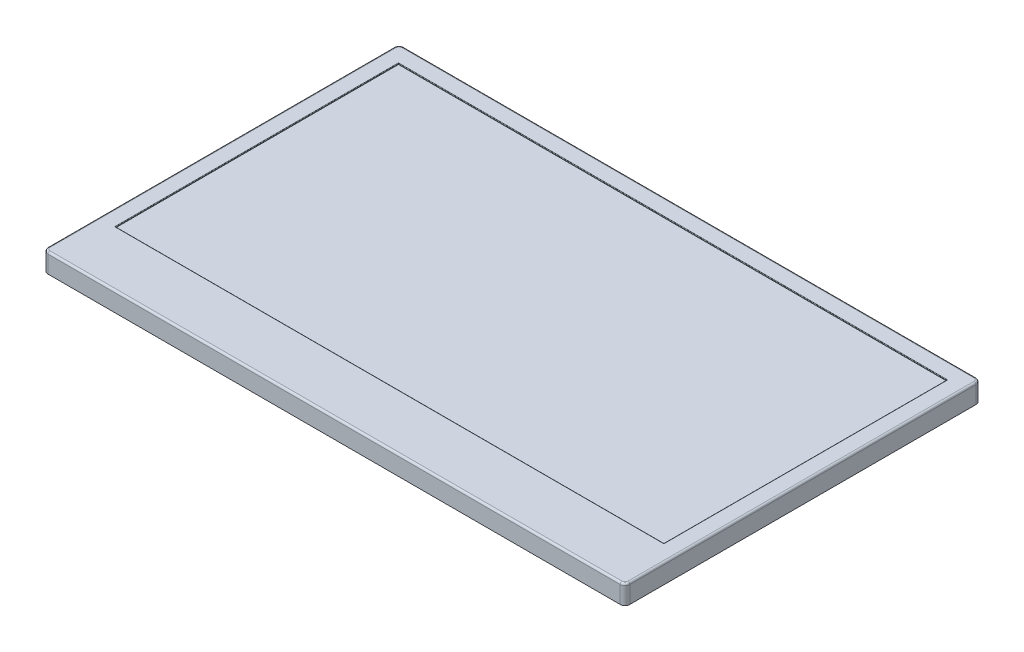
ISO-10303-21;
HEADER;
FILE_DESCRIPTION(('STEP AP214'),'2;1');
FILE_NAME('part.step','',(''),(''),'','','');
FILE_SCHEMA(('AUTOMOTIVE_DESIGN { 1 0 10303 214 1 1 1 1 }'));
ENDSEC;
DATA;
#1=APPLICATION_CONTEXT('core data for automotive mechanical design processes');
#2=APPLICATION_PROTOCOL_DEFINITION('international standard','automotive_design',2000,#1);
#3=PRODUCT_CONTEXT('',#1,'mechanical');
#4=PRODUCT('Part','Part','',(#3));
#5=PRODUCT_RELATED_PRODUCT_CATEGORY('part','',(#4));
#6=PRODUCT_DEFINITION_FORMATION('','',#4);
#7=PRODUCT_DEFINITION_CONTEXT('part definition',#1,'design');
#8=PRODUCT_DEFINITION('design','',#6,#7);
#9=PRODUCT_DEFINITION_SHAPE('','',#8);
#10=(LENGTH_UNIT() NAMED_UNIT(*) SI_UNIT(.MILLI.,.METRE.));
#11=(NAMED_UNIT(*) PLANE_ANGLE_UNIT() SI_UNIT($,.RADIAN.));
#12=(NAMED_UNIT(*) SI_UNIT($,.STERADIAN.) SOLID_ANGLE_UNIT());
#13=UNCERTAINTY_MEASURE_WITH_UNIT(LENGTH_MEASURE(1.E-05),#10,'distance_accuracy_value','');
#14=(GEOMETRIC_REPRESENTATION_CONTEXT(3) GLOBAL_UNCERTAINTY_ASSIGNED_CONTEXT((#13)) GLOBAL_UNIT_ASSIGNED_CONTEXT((#10,
#11,#12)) REPRESENTATION_CONTEXT('',''));
#15=CARTESIAN_POINT('',(0.,0.,0.));
#16=DIRECTION('',(0.,0.,1.));
#17=DIRECTION('',(1.,0.,0.));
#18=AXIS2_PLACEMENT_3D('',#15,#16,#17);
#19=CARTESIAN_POINT('',(0.,2.,0.));
#20=DIRECTION('',(-1.,0.,0.));
#21=DIRECTION('',(0.,0.,1.));
#22=AXIS2_PLACEMENT_3D('',#19,#20,#21);
#23=PLANE('',#22);
#24=DIRECTION('',(0.,-1.,0.));
#25=VECTOR('',#24,1.);
#26=CARTESIAN_POINT('',(0.,2.,-0.5));
#27=LINE('',#26,#25);
#28=CARTESIAN_POINT('',(0.,0.,-0.5));
#29=VERTEX_POINT('',#28);
#30=CARTESIAN_POINT('',(0.,1.8,-0.5));
#31=VERTEX_POINT('',#30);
#32=EDGE_CURVE('E226',#29,#31,#27,.F.);
#33=ORIENTED_EDGE('',*,*,#32,.T.);
#34=DIRECTION('',(0.,0.,-1.));
#35=VECTOR('',#34,1.);
#36=CARTESIAN_POINT('',(0.,1.8,-36.5));
#37=LINE('',#36,#35);
#38=CARTESIAN_POINT('',(0.,1.8,-36.5));
#39=VERTEX_POINT('',#38);
#40=EDGE_CURVE('E271',#31,#39,#37,.T.);
#41=ORIENTED_EDGE('',*,*,#40,.T.);
#42=DIRECTION('',(0.,-1.,0.));
#43=VECTOR('',#42,1.);
#44=CARTESIAN_POINT('',(0.,2.,-36.5));
#45=LINE('',#44,#43);
#46=CARTESIAN_POINT('',(0.,0.,-36.5));
#47=VERTEX_POINT('',#46);
#48=EDGE_CURVE('E224',#39,#47,#45,.T.);
#49=ORIENTED_EDGE('',*,*,#48,.T.);
#50=DIRECTION('',(0.,0.,-1.));
#51=VECTOR('',#50,1.);
#52=CARTESIAN_POINT('',(0.,0.,0.));
#53=LINE('',#52,#51);
#54=EDGE_CURVE('E196',#29,#47,#53,.T.);
#55=ORIENTED_EDGE('',*,*,#54,.F.);
#56=EDGE_LOOP('',(#33,#41,#49,#55));
#57=FACE_BOUND('',#56,.T.);
#58=ADVANCED_FACE('F37',(#57),#23,.T.);
#59=CARTESIAN_POINT('',(0.,2.,0.));
#60=DIRECTION('',(0.,0.,-1.));
#61=DIRECTION('',(-1.,0.,0.));
#62=AXIS2_PLACEMENT_3D('',#59,#60,#61);
#63=PLANE('',#62);
#64=DIRECTION('',(0.,-1.,0.));
#65=VECTOR('',#64,1.);
#66=CARTESIAN_POINT('',(60.,2.,0.));
#67=LINE('',#66,#65);
#68=CARTESIAN_POINT('',(60.,0.,0.));
#69=VERTEX_POINT('',#68);
#70=CARTESIAN_POINT('',(60.,1.8,0.));
#71=VERTEX_POINT('',#70);
#72=EDGE_CURVE('E211',#69,#71,#67,.F.);
#73=ORIENTED_EDGE('',*,*,#72,.T.);
#74=DIRECTION('',(1.,0.,0.));
#75=VECTOR('',#74,1.);
#76=CARTESIAN_POINT('',(0.,1.8,0.));
#77=LINE('',#76,#75);
#78=CARTESIAN_POINT('',(0.5,1.8,0.));
#79=VERTEX_POINT('',#78);
#80=EDGE_CURVE('E259',#71,#79,#77,.F.);
#81=ORIENTED_EDGE('',*,*,#80,.T.);
#82=DIRECTION('',(0.,-1.,0.));
#83=VECTOR('',#82,1.);
#84=CARTESIAN_POINT('',(0.5,0.,0.));
#85=LINE('',#84,#83);
#86=CARTESIAN_POINT('',(0.5,0.,0.));
#87=VERTEX_POINT('',#86);
#88=EDGE_CURVE('E214',#79,#87,#85,.T.);
#89=ORIENTED_EDGE('',*,*,#88,.T.);
#90=DIRECTION('',(1.,0.,0.));
#91=VECTOR('',#90,1.);
#92=CARTESIAN_POINT('',(0.,0.,0.));
#93=LINE('',#92,#91);
#94=EDGE_CURVE('E208',#87,#69,#93,.T.);
#95=ORIENTED_EDGE('',*,*,#94,.T.);
#96=EDGE_LOOP('',(#73,#81,#89,#95));
#97=FACE_BOUND('',#96,.T.);
#98=ADVANCED_FACE('F341',(#97),#63,.F.);
#99=CARTESIAN_POINT('',(60.5,2.,0.));
#100=DIRECTION('',(-1.,0.,0.));
#101=DIRECTION('',(0.,0.,1.));
#102=AXIS2_PLACEMENT_3D('',#99,#100,#101);
#103=PLANE('',#102);
#104=DIRECTION('',(0.,-1.,0.));
#105=VECTOR('',#104,1.);
#106=CARTESIAN_POINT('',(60.5,2.,-36.5));
#107=LINE('',#106,#105);
#108=CARTESIAN_POINT('',(60.5,0.,-36.5));
#109=VERTEX_POINT('',#108);
#110=CARTESIAN_POINT('',(60.5,1.8,-36.5));
#111=VERTEX_POINT('',#110);
#112=EDGE_CURVE('E229',#109,#111,#107,.F.);
#113=ORIENTED_EDGE('',*,*,#112,.T.);
#114=DIRECTION('',(0.,0.,-1.));
#115=VECTOR('',#114,1.);
#116=CARTESIAN_POINT('',(60.5,1.8,0.));
#117=LINE('',#116,#115);
#118=CARTESIAN_POINT('',(60.5,1.8,-0.5));
#119=VERTEX_POINT('',#118);
#120=EDGE_CURVE('E263',#111,#119,#117,.F.);
#121=ORIENTED_EDGE('',*,*,#120,.T.);
#122=DIRECTION('',(0.,-1.,0.));
#123=VECTOR('',#122,1.);
#124=CARTESIAN_POINT('',(60.5,2.,-0.5));
#125=LINE('',#124,#123);
#126=CARTESIAN_POINT('',(60.5,0.,-0.5));
#127=VERTEX_POINT('',#126);
#128=EDGE_CURVE('E232',#119,#127,#125,.T.);
#129=ORIENTED_EDGE('',*,*,#128,.T.);
#130=DIRECTION('',(0.,0.,-1.));
#131=VECTOR('',#130,1.);
#132=CARTESIAN_POINT('',(60.5,0.,0.));
#133=LINE('',#132,#131);
#134=EDGE_CURVE('E205',#127,#109,#133,.T.);
#135=ORIENTED_EDGE('',*,*,#134,.T.);
#136=EDGE_LOOP('',(#113,#121,#129,#135));
#137=FACE_BOUND('',#136,.T.);
#138=ADVANCED_FACE('F347',(#137),#103,.F.);
#139=CARTESIAN_POINT('',(0.,2.,-37.));
#140=DIRECTION('',(0.,0.,-1.));
#141=DIRECTION('',(-1.,0.,0.));
#142=AXIS2_PLACEMENT_3D('',#139,#140,#141);
#143=PLANE('',#142);
#144=DIRECTION('',(0.,-1.,0.));
#145=VECTOR('',#144,1.);
#146=CARTESIAN_POINT('',(0.5,2.,-37.));
#147=LINE('',#146,#145);
#148=CARTESIAN_POINT('',(0.5,0.,-37.));
#149=VERTEX_POINT('',#148);
#150=CARTESIAN_POINT('',(0.5,1.8,-37.));
#151=VERTEX_POINT('',#150);
#152=EDGE_CURVE('E234',#149,#151,#147,.F.);
#153=ORIENTED_EDGE('',*,*,#152,.T.);
#154=DIRECTION('',(1.,0.,0.));
#155=VECTOR('',#154,1.);
#156=CARTESIAN_POINT('',(60.,1.8,-37.));
#157=LINE('',#156,#155);
#158=CARTESIAN_POINT('',(60.,1.8,-37.));
#159=VERTEX_POINT('',#158);
#160=EDGE_CURVE('E267',#151,#159,#157,.T.);
#161=ORIENTED_EDGE('',*,*,#160,.T.);
#162=DIRECTION('',(0.,-1.,0.));
#163=VECTOR('',#162,1.);
#164=CARTESIAN_POINT('',(60.,0.,-37.));
#165=LINE('',#164,#163);
#166=CARTESIAN_POINT('',(60.,0.,-37.));
#167=VERTEX_POINT('',#166);
#168=EDGE_CURVE('E237',#159,#167,#165,.T.);
#169=ORIENTED_EDGE('',*,*,#168,.T.);
#170=DIRECTION('',(1.,0.,0.));
#171=VECTOR('',#170,1.);
#172=CARTESIAN_POINT('',(0.,0.,-37.));
#173=LINE('',#172,#171);
#174=EDGE_CURVE('E202',#149,#167,#173,.T.);
#175=ORIENTED_EDGE('',*,*,#174,.F.);
#176=EDGE_LOOP('',(#153,#161,#169,#175));
#177=FACE_BOUND('',#176,.T.);
#178=ADVANCED_FACE('F352',(#177),#143,.T.);
#179=CARTESIAN_POINT('',(0.,2.,0.));
#180=DIRECTION('',(0.,-1.,0.));
#181=DIRECTION('',(0.,0.,-1.));
#182=AXIS2_PLACEMENT_3D('',#179,#180,#181);
#183=PLANE('',#182);
#184=DIRECTION('',(0.,0.,-1.));
#185=VECTOR('',#184,1.);
#186=CARTESIAN_POINT('',(58.805,2.,0.));
#187=LINE('',#186,#185);
#188=CARTESIAN_POINT('',(58.805,2.,-35.25));
#189=VERTEX_POINT('',#188);
#190=CARTESIAN_POINT('',(58.805,2.,-5.74));
#191=VERTEX_POINT('',#190);
#192=EDGE_CURVE('E297',#189,#191,#187,.F.);
#193=ORIENTED_EDGE('',*,*,#192,.T.);
#194=DIRECTION('',(1.,0.,0.));
#195=VECTOR('',#194,1.);
#196=CARTESIAN_POINT('',(0.,2.,-5.74));
#197=LINE('',#196,#195);
#198=CARTESIAN_POINT('',(1.695,2.,-5.74));
#199=VERTEX_POINT('',#198);
#200=EDGE_CURVE('E299',#191,#199,#197,.F.);
#201=ORIENTED_EDGE('',*,*,#200,.T.);
#202=DIRECTION('',(0.,0.,1.));
#203=VECTOR('',#202,1.);
#204=CARTESIAN_POINT('',(1.695,2.,0.));
#205=LINE('',#204,#203);
#206=CARTESIAN_POINT('',(1.695,2.,-35.25));
#207=VERTEX_POINT('',#206);
#208=EDGE_CURVE('E293',#199,#207,#205,.F.);
#209=ORIENTED_EDGE('',*,*,#208,.T.);
#210=DIRECTION('',(-1.,0.,0.));
#211=VECTOR('',#210,1.);
#212=CARTESIAN_POINT('',(0.,2.,-35.25));
#213=LINE('',#212,#211);
#214=EDGE_CURVE('E295',#207,#189,#213,.F.);
#215=ORIENTED_EDGE('',*,*,#214,.T.);
#216=EDGE_LOOP('',(#193,#201,#209,#215));
#217=FACE_BOUND('',#216,.T.);
#218=DIRECTION('',(0.,0.,-1.));
#219=VECTOR('',#218,1.);
#220=CARTESIAN_POINT('',(0.2,2.,-0.5));
#221=LINE('',#220,#219);
#222=CARTESIAN_POINT('',(0.2,2.,-36.5));
#223=VERTEX_POINT('',#222);
#224=CARTESIAN_POINT('',(0.2,2.,-0.5));
#225=VERTEX_POINT('',#224);
#226=EDGE_CURVE('E239',#223,#225,#221,.F.);
#227=ORIENTED_EDGE('',*,*,#226,.T.);
#228=CARTESIAN_POINT('',(0.5,2.,-0.5));
#229=DIRECTION('',(0.,-1.,0.));
#230=DIRECTION('',(0.,0.,-1.));
#231=AXIS2_PLACEMENT_3D('',#228,#229,#230);
#232=CIRCLE('',#231,0.3);
#233=CARTESIAN_POINT('',(0.5,2.,-0.2));
#234=VERTEX_POINT('',#233);
#235=EDGE_CURVE('E253',#225,#234,#232,.F.);
#236=ORIENTED_EDGE('',*,*,#235,.T.);
#237=DIRECTION('',(1.,0.,0.));
#238=VECTOR('',#237,1.);
#239=CARTESIAN_POINT('',(0.,2.,-0.2));
#240=LINE('',#239,#238);
#241=CARTESIAN_POINT('',(60.,2.,-0.2));
#242=VERTEX_POINT('',#241);
#243=EDGE_CURVE('E251',#234,#242,#240,.T.);
#244=ORIENTED_EDGE('',*,*,#243,.T.);
#245=CARTESIAN_POINT('',(60.,2.,-0.5));
#246=DIRECTION('',(0.,-1.,0.));
#247=DIRECTION('',(0.,0.,-1.));
#248=AXIS2_PLACEMENT_3D('',#245,#246,#247);
#249=CIRCLE('',#248,0.3);
#250=CARTESIAN_POINT('',(60.3,2.,-0.5));
#251=VERTEX_POINT('',#250);
#252=EDGE_CURVE('E249',#242,#251,#249,.F.);
#253=ORIENTED_EDGE('',*,*,#252,.T.);
#254=DIRECTION('',(0.,0.,-1.));
#255=VECTOR('',#254,1.);
#256=CARTESIAN_POINT('',(60.3,2.,0.));
#257=LINE('',#256,#255);
#258=CARTESIAN_POINT('',(60.3,2.,-36.5));
#259=VERTEX_POINT('',#258);
#260=EDGE_CURVE('E247',#251,#259,#257,.T.);
#261=ORIENTED_EDGE('',*,*,#260,.T.);
#262=CARTESIAN_POINT('',(60.,2.,-36.5));
#263=DIRECTION('',(0.,-1.,0.));
#264=DIRECTION('',(0.,0.,-1.));
#265=AXIS2_PLACEMENT_3D('',#262,#263,#264);
#266=CIRCLE('',#265,0.3);
#267=CARTESIAN_POINT('',(60.,2.,-36.8));
#268=VERTEX_POINT('',#267);
#269=EDGE_CURVE('E245',#259,#268,#266,.F.);
#270=ORIENTED_EDGE('',*,*,#269,.T.);
#271=DIRECTION('',(1.,0.,0.));
#272=VECTOR('',#271,1.);
#273=CARTESIAN_POINT('',(0.5,2.,-36.8));
#274=LINE('',#273,#272);
#275=CARTESIAN_POINT('',(0.5,2.,-36.8));
#276=VERTEX_POINT('',#275);
#277=EDGE_CURVE('E243',#268,#276,#274,.F.);
#278=ORIENTED_EDGE('',*,*,#277,.T.);
#279=CARTESIAN_POINT('',(0.5,2.,-36.5));
#280=DIRECTION('',(0.,-1.,0.));
#281=DIRECTION('',(0.,0.,-1.));
#282=AXIS2_PLACEMENT_3D('',#279,#280,#281);
#283=CIRCLE('',#282,0.3);
#284=EDGE_CURVE('E241',#276,#223,#283,.F.);
#285=ORIENTED_EDGE('',*,*,#284,.T.);
#286=EDGE_LOOP('',(#227,#236,#244,#253,#261,#270,#278,#285));
#287=FACE_BOUND('',#286,.T.);
#288=ADVANCED_FACE('F320',(#217,#287),#183,.F.);
#289=CARTESIAN_POINT('',(0.,0.,0.));
#290=DIRECTION('',(0.,-1.,0.));
#291=DIRECTION('',(0.,0.,-1.));
#292=AXIS2_PLACEMENT_3D('',#289,#290,#291);
#293=PLANE('',#292);
#294=ORIENTED_EDGE('',*,*,#94,.F.);
#295=CARTESIAN_POINT('',(0.5,0.,-0.5));
#296=DIRECTION('',(0.,-1.,0.));
#297=DIRECTION('',(0.,0.,-1.));
#298=AXIS2_PLACEMENT_3D('',#295,#296,#297);
#299=CIRCLE('',#298,0.5);
#300=EDGE_CURVE('E222',#87,#29,#299,.T.);
#301=ORIENTED_EDGE('',*,*,#300,.T.);
#302=ORIENTED_EDGE('',*,*,#54,.T.);
#303=CARTESIAN_POINT('',(0.5,0.,-36.5));
#304=DIRECTION('',(0.,-1.,0.));
#305=DIRECTION('',(0.,0.,-1.));
#306=AXIS2_PLACEMENT_3D('',#303,#304,#305);
#307=CIRCLE('',#306,0.5);
#308=EDGE_CURVE('E216',#47,#149,#307,.T.);
#309=ORIENTED_EDGE('',*,*,#308,.T.);
#310=ORIENTED_EDGE('',*,*,#174,.T.);
#311=CARTESIAN_POINT('',(60.,0.,-36.5));
#312=DIRECTION('',(0.,-1.,0.));
#313=DIRECTION('',(0.,0.,-1.));
#314=AXIS2_PLACEMENT_3D('',#311,#312,#313);
#315=CIRCLE('',#314,0.5);
#316=EDGE_CURVE('E218',#167,#109,#315,.T.);
#317=ORIENTED_EDGE('',*,*,#316,.T.);
#318=ORIENTED_EDGE('',*,*,#134,.F.);
#319=CARTESIAN_POINT('',(60.,0.,-0.5));
#320=DIRECTION('',(0.,-1.,0.));
#321=DIRECTION('',(0.,0.,-1.));
#322=AXIS2_PLACEMENT_3D('',#319,#320,#321);
#323=CIRCLE('',#322,0.5);
#324=EDGE_CURVE('E220',#127,#69,#323,.T.);
#325=ORIENTED_EDGE('',*,*,#324,.T.);
#326=EDGE_LOOP('',(#294,#301,#302,#309,#310,#317,#318,#325));
#327=FACE_BOUND('',#326,.T.);
#328=ADVANCED_FACE('F337',(#327),#293,.T.);
#329=CARTESIAN_POINT('',(1.745,1.9,-35.2));
#330=DIRECTION('',(-1.,0.,0.));
#331=DIRECTION('',(0.,0.,1.));
#332=AXIS2_PLACEMENT_3D('',#329,#330,#331);
#333=PLANE('',#332);
#334=DIRECTION('',(0.,1.,0.));
#335=VECTOR('',#334,1.);
#336=CARTESIAN_POINT('',(1.745,1.9,-35.2));
#337=LINE('',#336,#335);
#338=CARTESIAN_POINT('',(1.745,1.9,-35.2));
#339=VERTEX_POINT('',#338);
#340=CARTESIAN_POINT('',(1.745,1.95,-35.2));
#341=VERTEX_POINT('',#340);
#342=EDGE_CURVE('E194',#339,#341,#337,.T.);
#343=ORIENTED_EDGE('',*,*,#342,.T.);
#344=DIRECTION('',(0.,0.,1.));
#345=VECTOR('',#344,1.);
#346=CARTESIAN_POINT('',(1.745,1.95,-35.2));
#347=LINE('',#346,#345);
#348=CARTESIAN_POINT('',(1.745,1.95,-5.79));
#349=VERTEX_POINT('',#348);
#350=EDGE_CURVE('E11',#341,#349,#347,.T.);
#351=ORIENTED_EDGE('',*,*,#350,.T.);
#352=DIRECTION('',(0.,1.,0.));
#353=VECTOR('',#352,1.);
#354=CARTESIAN_POINT('',(1.745,1.9,-5.79));
#355=LINE('',#354,#353);
#356=CARTESIAN_POINT('',(1.745,1.9,-5.79));
#357=VERTEX_POINT('',#356);
#358=EDGE_CURVE('E163',#357,#349,#355,.T.);
#359=ORIENTED_EDGE('',*,*,#358,.F.);
#360=DIRECTION('',(0.,0.,1.));
#361=VECTOR('',#360,1.);
#362=CARTESIAN_POINT('',(1.745,1.9,-35.2));
#363=LINE('',#362,#361);
#364=EDGE_CURVE('E167',#339,#357,#363,.T.);
#365=ORIENTED_EDGE('',*,*,#364,.F.);
#366=EDGE_LOOP('',(#343,#351,#359,#365));
#367=FACE_BOUND('',#366,.T.);
#368=ADVANCED_FACE('F165',(#367),#333,.F.);
#369=CARTESIAN_POINT('',(1.745,1.9,-35.2));
#370=DIRECTION('',(0.,0.,-1.));
#371=DIRECTION('',(-1.,0.,0.));
#372=AXIS2_PLACEMENT_3D('',#369,#370,#371);
#373=PLANE('',#372);
#374=DIRECTION('',(0.,1.,0.));
#375=VECTOR('',#374,1.);
#376=CARTESIAN_POINT('',(58.755,1.9,-35.2));
#377=LINE('',#376,#375);
#378=CARTESIAN_POINT('',(58.755,1.9,-35.2));
#379=VERTEX_POINT('',#378);
#380=CARTESIAN_POINT('',(58.755,1.95,-35.2));
#381=VERTEX_POINT('',#380);
#382=EDGE_CURVE('E197',#379,#381,#377,.T.);
#383=ORIENTED_EDGE('',*,*,#382,.T.);
#384=DIRECTION('',(-1.,0.,0.));
#385=VECTOR('',#384,1.);
#386=CARTESIAN_POINT('',(1.745,1.95,-35.2));
#387=LINE('',#386,#385);
#388=EDGE_CURVE('E46',#381,#341,#387,.T.);
#389=ORIENTED_EDGE('',*,*,#388,.T.);
#390=ORIENTED_EDGE('',*,*,#342,.F.);
#391=DIRECTION('',(-1.,0.,0.));
#392=VECTOR('',#391,1.);
#393=CARTESIAN_POINT('',(1.745,1.9,-35.2));
#394=LINE('',#393,#392);
#395=EDGE_CURVE('E174',#379,#339,#394,.T.);
#396=ORIENTED_EDGE('',*,*,#395,.F.);
#397=EDGE_LOOP('',(#383,#389,#390,#396));
#398=FACE_BOUND('',#397,.T.);
#399=ADVANCED_FACE('F329',(#398),#373,.F.);
#400=CARTESIAN_POINT('',(58.755,1.9,-35.2));
#401=DIRECTION('',(1.,0.,0.));
#402=DIRECTION('',(0.,0.,-1.));
#403=AXIS2_PLACEMENT_3D('',#400,#401,#402);
#404=PLANE('',#403);
#405=DIRECTION('',(0.,1.,0.));
#406=VECTOR('',#405,1.);
#407=CARTESIAN_POINT('',(58.755,1.9,-5.79));
#408=LINE('',#407,#406);
#409=CARTESIAN_POINT('',(58.755,1.9,-5.79));
#410=VERTEX_POINT('',#409);
#411=CARTESIAN_POINT('',(58.755,1.95,-5.79));
#412=VERTEX_POINT('',#411);
#413=EDGE_CURVE('E173',#410,#412,#408,.T.);
#414=ORIENTED_EDGE('',*,*,#413,.T.);
#415=DIRECTION('',(0.,0.,-1.));
#416=VECTOR('',#415,1.);
#417=CARTESIAN_POINT('',(58.755,1.95,-35.2));
#418=LINE('',#417,#416);
#419=EDGE_CURVE('E61',#412,#381,#418,.T.);
#420=ORIENTED_EDGE('',*,*,#419,.T.);
#421=ORIENTED_EDGE('',*,*,#382,.F.);
#422=DIRECTION('',(0.,0.,-1.));
#423=VECTOR('',#422,1.);
#424=CARTESIAN_POINT('',(58.755,1.9,-35.2));
#425=LINE('',#424,#423);
#426=EDGE_CURVE('E182',#410,#379,#425,.T.);
#427=ORIENTED_EDGE('',*,*,#426,.F.);
#428=EDGE_LOOP('',(#414,#420,#421,#427));
#429=FACE_BOUND('',#428,.T.);
#430=ADVANCED_FACE('F328',(#429),#404,.F.);
#431=CARTESIAN_POINT('',(1.745,1.9,-5.79));
#432=DIRECTION('',(0.,0.,1.));
#433=DIRECTION('',(1.,0.,0.));
#434=AXIS2_PLACEMENT_3D('',#431,#432,#433);
#435=PLANE('',#434);
#436=ORIENTED_EDGE('',*,*,#358,.T.);
#437=DIRECTION('',(1.,0.,0.));
#438=VECTOR('',#437,1.);
#439=CARTESIAN_POINT('',(1.745,1.95,-5.79));
#440=LINE('',#439,#438);
#441=EDGE_CURVE('E273',#349,#412,#440,.T.);
#442=ORIENTED_EDGE('',*,*,#441,.T.);
#443=ORIENTED_EDGE('',*,*,#413,.F.);
#444=DIRECTION('',(1.,0.,0.));
#445=VECTOR('',#444,1.);
#446=CARTESIAN_POINT('',(1.745,1.9,-5.79));
#447=LINE('',#446,#445);
#448=EDGE_CURVE('E177',#357,#410,#447,.T.);
#449=ORIENTED_EDGE('',*,*,#448,.F.);
#450=EDGE_LOOP('',(#436,#442,#443,#449));
#451=FACE_BOUND('',#450,.T.);
#452=ADVANCED_FACE('F178',(#451),#435,.F.);
#453=CARTESIAN_POINT('',(0.,1.9,0.));
#454=DIRECTION('',(0.,1.,0.));
#455=DIRECTION('',(0.,0.,1.));
#456=AXIS2_PLACEMENT_3D('',#453,#454,#455);
#457=PLANE('',#456);
#458=ORIENTED_EDGE('',*,*,#364,.T.);
#459=ORIENTED_EDGE('',*,*,#448,.T.);
#460=ORIENTED_EDGE('',*,*,#426,.T.);
#461=ORIENTED_EDGE('',*,*,#395,.T.);
#462=EDGE_LOOP('',(#458,#459,#460,#461));
#463=FACE_BOUND('',#462,.T.);
#464=ADVANCED_FACE('F184',(#463),#457,.T.);
#465=CARTESIAN_POINT('',(0.5,2.,-0.5));
#466=DIRECTION('',(0.,1.,0.));
#467=DIRECTION('',(0.,0.,1.));
#468=AXIS2_PLACEMENT_3D('',#465,#466,#467);
#469=CYLINDRICAL_SURFACE('',#468,0.5);
#470=ORIENTED_EDGE('',*,*,#88,.F.);
#471=CARTESIAN_POINT('',(0.5,1.8,-0.5));
#472=DIRECTION('',(0.,-1.,0.));
#473=DIRECTION('',(0.,0.,-1.));
#474=AXIS2_PLACEMENT_3D('',#471,#472,#473);
#475=CIRCLE('',#474,0.5);
#476=EDGE_CURVE('E256',#79,#31,#475,.T.);
#477=ORIENTED_EDGE('',*,*,#476,.T.);
#478=ORIENTED_EDGE('',*,*,#32,.F.);
#479=ORIENTED_EDGE('',*,*,#300,.F.);
#480=EDGE_LOOP('',(#470,#477,#478,#479));
#481=FACE_BOUND('',#480,.T.);
#482=ADVANCED_FACE('F354',(#481),#469,.T.);
#483=CARTESIAN_POINT('',(60.,2.,-0.5));
#484=DIRECTION('',(0.,-1.,0.));
#485=DIRECTION('',(0.,0.,-1.));
#486=AXIS2_PLACEMENT_3D('',#483,#484,#485);
#487=CYLINDRICAL_SURFACE('',#486,0.5);
#488=ORIENTED_EDGE('',*,*,#128,.F.);
#489=CARTESIAN_POINT('',(60.,1.8,-0.5));
#490=DIRECTION('',(0.,-1.,0.));
#491=DIRECTION('',(0.,0.,-1.));
#492=AXIS2_PLACEMENT_3D('',#489,#490,#491);
#493=CIRCLE('',#492,0.5);
#494=EDGE_CURVE('E261',#119,#71,#493,.T.);
#495=ORIENTED_EDGE('',*,*,#494,.T.);
#496=ORIENTED_EDGE('',*,*,#72,.F.);
#497=ORIENTED_EDGE('',*,*,#324,.F.);
#498=EDGE_LOOP('',(#488,#495,#496,#497));
#499=FACE_BOUND('',#498,.T.);
#500=ADVANCED_FACE('F357',(#499),#487,.T.);
#501=CARTESIAN_POINT('',(60.,2.,-36.5));
#502=DIRECTION('',(0.,1.,0.));
#503=DIRECTION('',(0.,0.,1.));
#504=AXIS2_PLACEMENT_3D('',#501,#502,#503);
#505=CYLINDRICAL_SURFACE('',#504,0.5);
#506=ORIENTED_EDGE('',*,*,#168,.F.);
#507=CARTESIAN_POINT('',(60.,1.8,-36.5));
#508=DIRECTION('',(0.,-1.,0.));
#509=DIRECTION('',(0.,0.,-1.));
#510=AXIS2_PLACEMENT_3D('',#507,#508,#509);
#511=CIRCLE('',#510,0.5);
#512=EDGE_CURVE('E265',#159,#111,#511,.T.);
#513=ORIENTED_EDGE('',*,*,#512,.T.);
#514=ORIENTED_EDGE('',*,*,#112,.F.);
#515=ORIENTED_EDGE('',*,*,#316,.F.);
#516=EDGE_LOOP('',(#506,#513,#514,#515));
#517=FACE_BOUND('',#516,.T.);
#518=ADVANCED_FACE('F361',(#517),#505,.T.);
#519=CARTESIAN_POINT('',(0.5,2.,-36.5));
#520=DIRECTION('',(0.,-1.,0.));
#521=DIRECTION('',(0.,0.,-1.));
#522=AXIS2_PLACEMENT_3D('',#519,#520,#521);
#523=CYLINDRICAL_SURFACE('',#522,0.5);
#524=ORIENTED_EDGE('',*,*,#48,.F.);
#525=CARTESIAN_POINT('',(0.5,1.8,-36.5));
#526=DIRECTION('',(0.,-1.,0.));
#527=DIRECTION('',(0.,0.,-1.));
#528=AXIS2_PLACEMENT_3D('',#525,#526,#527);
#529=CIRCLE('',#528,0.5);
#530=EDGE_CURVE('E269',#39,#151,#529,.T.);
#531=ORIENTED_EDGE('',*,*,#530,.T.);
#532=ORIENTED_EDGE('',*,*,#152,.F.);
#533=ORIENTED_EDGE('',*,*,#308,.F.);
#534=EDGE_LOOP('',(#524,#531,#532,#533));
#535=FACE_BOUND('',#534,.T.);
#536=ADVANCED_FACE('F365',(#535),#523,.T.);
#537=CARTESIAN_POINT('',(60.,1.8,-36.5));
#538=DIRECTION('',(0.,-1.,0.));
#539=DIRECTION('',(0.,0.,-1.));
#540=AXIS2_PLACEMENT_3D('',#537,#538,#539);
#541=TOROIDAL_SURFACE('',#540,0.3,0.2);
#542=CARTESIAN_POINT('',(60.3,1.8,-36.5));
#543=DIRECTION('',(0.,0.,1.));
#544=DIRECTION('',(1.,0.,0.));
#545=AXIS2_PLACEMENT_3D('',#542,#543,#544);
#546=CIRCLE('',#545,0.2);
#547=EDGE_CURVE('E189',#111,#259,#546,.T.);
#548=ORIENTED_EDGE('',*,*,#547,.F.);
#549=ORIENTED_EDGE('',*,*,#512,.F.);
#550=CARTESIAN_POINT('',(60.,1.8,-36.8));
#551=DIRECTION('',(-1.,0.,0.));
#552=DIRECTION('',(0.,0.,1.));
#553=AXIS2_PLACEMENT_3D('',#550,#551,#552);
#554=CIRCLE('',#553,0.2);
#555=EDGE_CURVE('E186',#268,#159,#554,.T.);
#556=ORIENTED_EDGE('',*,*,#555,.F.);
#557=ORIENTED_EDGE('',*,*,#269,.F.);
#558=EDGE_LOOP('',(#548,#549,#556,#557));
#559=FACE_BOUND('',#558,.T.);
#560=ADVANCED_FACE('F369',(#559),#541,.T.);
#561=CARTESIAN_POINT('',(0.,1.8,-36.8));
#562=DIRECTION('',(-1.,0.,0.));
#563=DIRECTION('',(0.,0.,1.));
#564=AXIS2_PLACEMENT_3D('',#561,#562,#563);
#565=CYLINDRICAL_SURFACE('',#564,0.2);
#566=ORIENTED_EDGE('',*,*,#555,.T.);
#567=ORIENTED_EDGE('',*,*,#160,.F.);
#568=CARTESIAN_POINT('',(0.5,1.8,-36.8));
#569=DIRECTION('',(-1.,0.,0.));
#570=DIRECTION('',(0.,0.,1.));
#571=AXIS2_PLACEMENT_3D('',#568,#569,#570);
#572=CIRCLE('',#571,0.2);
#573=EDGE_CURVE('E287',#276,#151,#572,.T.);
#574=ORIENTED_EDGE('',*,*,#573,.F.);
#575=ORIENTED_EDGE('',*,*,#277,.F.);
#576=EDGE_LOOP('',(#566,#567,#574,#575));
#577=FACE_BOUND('',#576,.T.);
#578=ADVANCED_FACE('F394',(#577),#565,.T.);
#579=CARTESIAN_POINT('',(60.3,1.8,0.));
#580=DIRECTION('',(0.,0.,-1.));
#581=DIRECTION('',(-1.,0.,0.));
#582=AXIS2_PLACEMENT_3D('',#579,#580,#581);
#583=CYLINDRICAL_SURFACE('',#582,0.2);
#584=ORIENTED_EDGE('',*,*,#547,.T.);
#585=ORIENTED_EDGE('',*,*,#260,.F.);
#586=CARTESIAN_POINT('',(60.3,1.8,-0.5));
#587=DIRECTION('',(0.,0.,1.));
#588=DIRECTION('',(1.,0.,0.));
#589=AXIS2_PLACEMENT_3D('',#586,#587,#588);
#590=CIRCLE('',#589,0.2);
#591=EDGE_CURVE('E284',#119,#251,#590,.T.);
#592=ORIENTED_EDGE('',*,*,#591,.F.);
#593=ORIENTED_EDGE('',*,*,#120,.F.);
#594=EDGE_LOOP('',(#584,#585,#592,#593));
#595=FACE_BOUND('',#594,.T.);
#596=ADVANCED_FACE('F390',(#595),#583,.T.);
#597=CARTESIAN_POINT('',(0.5,1.8,-36.5));
#598=DIRECTION('',(0.,-1.,0.));
#599=DIRECTION('',(0.,0.,-1.));
#600=AXIS2_PLACEMENT_3D('',#597,#598,#599);
#601=TOROIDAL_SURFACE('',#600,0.3,0.2);
#602=ORIENTED_EDGE('',*,*,#573,.T.);
#603=ORIENTED_EDGE('',*,*,#530,.F.);
#604=CARTESIAN_POINT('',(0.2,1.8,-36.5));
#605=DIRECTION('',(0.,0.,1.));
#606=DIRECTION('',(1.,0.,0.));
#607=AXIS2_PLACEMENT_3D('',#604,#605,#606);
#608=CIRCLE('',#607,0.2);
#609=EDGE_CURVE('E281',#223,#39,#608,.T.);
#610=ORIENTED_EDGE('',*,*,#609,.F.);
#611=ORIENTED_EDGE('',*,*,#284,.F.);
#612=EDGE_LOOP('',(#602,#603,#610,#611));
#613=FACE_BOUND('',#612,.T.);
#614=ADVANCED_FACE('F386',(#613),#601,.T.);
#615=CARTESIAN_POINT('',(60.,1.8,-0.5));
#616=DIRECTION('',(0.,-1.,0.));
#617=DIRECTION('',(0.,0.,-1.));
#618=AXIS2_PLACEMENT_3D('',#615,#616,#617);
#619=TOROIDAL_SURFACE('',#618,0.3,0.2);
#620=ORIENTED_EDGE('',*,*,#591,.T.);
#621=ORIENTED_EDGE('',*,*,#252,.F.);
#622=CARTESIAN_POINT('',(60.,1.8,-0.2));
#623=DIRECTION('',(-1.,0.,0.));
#624=DIRECTION('',(0.,0.,1.));
#625=AXIS2_PLACEMENT_3D('',#622,#623,#624);
#626=CIRCLE('',#625,0.2);
#627=EDGE_CURVE('E278',#71,#242,#626,.T.);
#628=ORIENTED_EDGE('',*,*,#627,.F.);
#629=ORIENTED_EDGE('',*,*,#494,.F.);
#630=EDGE_LOOP('',(#620,#621,#628,#629));
#631=FACE_BOUND('',#630,.T.);
#632=ADVANCED_FACE('F382',(#631),#619,.T.);
#633=CARTESIAN_POINT('',(0.2,1.8,0.));
#634=DIRECTION('',(0.,0.,1.));
#635=DIRECTION('',(1.,0.,0.));
#636=AXIS2_PLACEMENT_3D('',#633,#634,#635);
#637=CYLINDRICAL_SURFACE('',#636,0.2);
#638=ORIENTED_EDGE('',*,*,#609,.T.);
#639=ORIENTED_EDGE('',*,*,#40,.F.);
#640=CARTESIAN_POINT('',(0.2,1.8,-0.5));
#641=DIRECTION('',(0.,0.,1.));
#642=DIRECTION('',(1.,0.,0.));
#643=AXIS2_PLACEMENT_3D('',#640,#641,#642);
#644=CIRCLE('',#643,0.2);
#645=EDGE_CURVE('E276',#225,#31,#644,.T.);
#646=ORIENTED_EDGE('',*,*,#645,.F.);
#647=ORIENTED_EDGE('',*,*,#226,.F.);
#648=EDGE_LOOP('',(#638,#639,#646,#647));
#649=FACE_BOUND('',#648,.T.);
#650=ADVANCED_FACE('F378',(#649),#637,.T.);
#651=CARTESIAN_POINT('',(0.,1.8,-0.2));
#652=DIRECTION('',(1.,0.,0.));
#653=DIRECTION('',(0.,0.,-1.));
#654=AXIS2_PLACEMENT_3D('',#651,#652,#653);
#655=CYLINDRICAL_SURFACE('',#654,0.2);
#656=ORIENTED_EDGE('',*,*,#627,.T.);
#657=ORIENTED_EDGE('',*,*,#243,.F.);
#658=CARTESIAN_POINT('',(0.5,1.8,-0.2));
#659=DIRECTION('',(-1.,0.,0.));
#660=DIRECTION('',(0.,0.,1.));
#661=AXIS2_PLACEMENT_3D('',#658,#659,#660);
#662=CIRCLE('',#661,0.2);
#663=EDGE_CURVE('E274',#79,#234,#662,.T.);
#664=ORIENTED_EDGE('',*,*,#663,.F.);
#665=ORIENTED_EDGE('',*,*,#80,.F.);
#666=EDGE_LOOP('',(#656,#657,#664,#665));
#667=FACE_BOUND('',#666,.T.);
#668=ADVANCED_FACE('F374',(#667),#655,.T.);
#669=CARTESIAN_POINT('',(0.5,1.8,-0.5));
#670=DIRECTION('',(0.,-1.,0.));
#671=DIRECTION('',(0.,0.,-1.));
#672=AXIS2_PLACEMENT_3D('',#669,#670,#671);
#673=TOROIDAL_SURFACE('',#672,0.3,0.2);
#674=ORIENTED_EDGE('',*,*,#645,.T.);
#675=ORIENTED_EDGE('',*,*,#476,.F.);
#676=ORIENTED_EDGE('',*,*,#663,.T.);
#677=ORIENTED_EDGE('',*,*,#235,.F.);
#678=EDGE_LOOP('',(#674,#675,#676,#677));
#679=FACE_BOUND('',#678,.T.);
#680=ADVANCED_FACE('F371',(#679),#673,.T.);
#681=CARTESIAN_POINT('',(1.745,1.95,-35.25));
#682=DIRECTION('',(-1.,0.,0.));
#683=DIRECTION('',(0.,0.,1.));
#684=AXIS2_PLACEMENT_3D('',#681,#682,#683);
#685=CYLINDRICAL_SURFACE('',#684,0.05);
#686=CARTESIAN_POINT('',(58.805,1.95,-35.25));
#687=DIRECTION('',(-0.707106781186547,0.,-0.707106781186548));
#688=DIRECTION('',(0.707106781186548,0.,-0.707106781186547));
#689=AXIS2_PLACEMENT_3D('',#686,#687,#688);
#690=ELLIPSE('',#689,0.0707106781186548,0.05);
#691=EDGE_CURVE('E307',#189,#381,#690,.F.);
#692=ORIENTED_EDGE('',*,*,#691,.F.);
#693=ORIENTED_EDGE('',*,*,#214,.F.);
#694=CARTESIAN_POINT('',(1.695,1.95,-35.25));
#695=DIRECTION('',(-0.707106781186547,0.,0.707106781186548));
#696=DIRECTION('',(-0.707106781186548,0.,-0.707106781186547));
#697=AXIS2_PLACEMENT_3D('',#694,#695,#696);
#698=ELLIPSE('',#697,0.0707106781186548,0.05);
#699=EDGE_CURVE('E41',#341,#207,#698,.T.);
#700=ORIENTED_EDGE('',*,*,#699,.F.);
#701=ORIENTED_EDGE('',*,*,#388,.F.);
#702=EDGE_LOOP('',(#692,#693,#700,#701));
#703=FACE_BOUND('',#702,.T.);
#704=ADVANCED_FACE('F39',(#703),#685,.T.);
#705=CARTESIAN_POINT('',(1.695,1.95,-35.2));
#706=DIRECTION('',(0.,0.,1.));
#707=DIRECTION('',(1.,0.,0.));
#708=AXIS2_PLACEMENT_3D('',#705,#706,#707);
#709=CYLINDRICAL_SURFACE('',#708,0.05);
#710=ORIENTED_EDGE('',*,*,#699,.T.);
#711=ORIENTED_EDGE('',*,*,#208,.F.);
#712=CARTESIAN_POINT('',(1.695,1.95,-5.74));
#713=DIRECTION('',(0.707106781186548,0.,0.707106781186547));
#714=DIRECTION('',(0.707106781186547,0.,-0.707106781186548));
#715=AXIS2_PLACEMENT_3D('',#712,#713,#714);
#716=ELLIPSE('',#715,0.0707106781186548,0.05);
#717=EDGE_CURVE('E306',#349,#199,#716,.T.);
#718=ORIENTED_EDGE('',*,*,#717,.F.);
#719=ORIENTED_EDGE('',*,*,#350,.F.);
#720=EDGE_LOOP('',(#710,#711,#718,#719));
#721=FACE_BOUND('',#720,.T.);
#722=ADVANCED_FACE('F316',(#721),#709,.T.);
#723=CARTESIAN_POINT('',(58.805,1.95,-35.2));
#724=DIRECTION('',(0.,0.,-1.));
#725=DIRECTION('',(-1.,0.,0.));
#726=AXIS2_PLACEMENT_3D('',#723,#724,#725);
#727=CYLINDRICAL_SURFACE('',#726,0.05);
#728=ORIENTED_EDGE('',*,*,#691,.T.);
#729=ORIENTED_EDGE('',*,*,#419,.F.);
#730=CARTESIAN_POINT('',(58.805,1.95,-5.74));
#731=DIRECTION('',(0.707106781186548,0.,-0.707106781186547));
#732=DIRECTION('',(0.707106781186547,0.,0.707106781186548));
#733=AXIS2_PLACEMENT_3D('',#730,#731,#732);
#734=ELLIPSE('',#733,0.0707106781186548,0.05);
#735=EDGE_CURVE('E304',#191,#412,#734,.F.);
#736=ORIENTED_EDGE('',*,*,#735,.F.);
#737=ORIENTED_EDGE('',*,*,#192,.F.);
#738=EDGE_LOOP('',(#728,#729,#736,#737));
#739=FACE_BOUND('',#738,.T.);
#740=ADVANCED_FACE('F327',(#739),#727,.T.);
#741=CARTESIAN_POINT('',(1.745,1.95,-5.74));
#742=DIRECTION('',(1.,0.,0.));
#743=DIRECTION('',(0.,0.,-1.));
#744=AXIS2_PLACEMENT_3D('',#741,#742,#743);
#745=CYLINDRICAL_SURFACE('',#744,0.05);
#746=ORIENTED_EDGE('',*,*,#717,.T.);
#747=ORIENTED_EDGE('',*,*,#200,.F.);
#748=ORIENTED_EDGE('',*,*,#735,.T.);
#749=ORIENTED_EDGE('',*,*,#441,.F.);
#750=EDGE_LOOP('',(#746,#747,#748,#749));
#751=FACE_BOUND('',#750,.T.);
#752=ADVANCED_FACE('F325',(#751),#745,.T.);
#753=CLOSED_SHELL('',(#58,#98,#138,#178,#288,#328,#368,#399,#430,#452,#464,#482,#500,#518,#536,
#560,#578,#596,#614,#632,#650,#668,#680,#704,#722,#740,#752));
#754=MANIFOLD_SOLID_BREP('B2',#753);
#755=ADVANCED_BREP_SHAPE_REPRESENTATION('',(#18,#754),#14);
#756=SHAPE_DEFINITION_REPRESENTATION(#9,#755);
ENDSEC;
END-ISO-10303-21;
